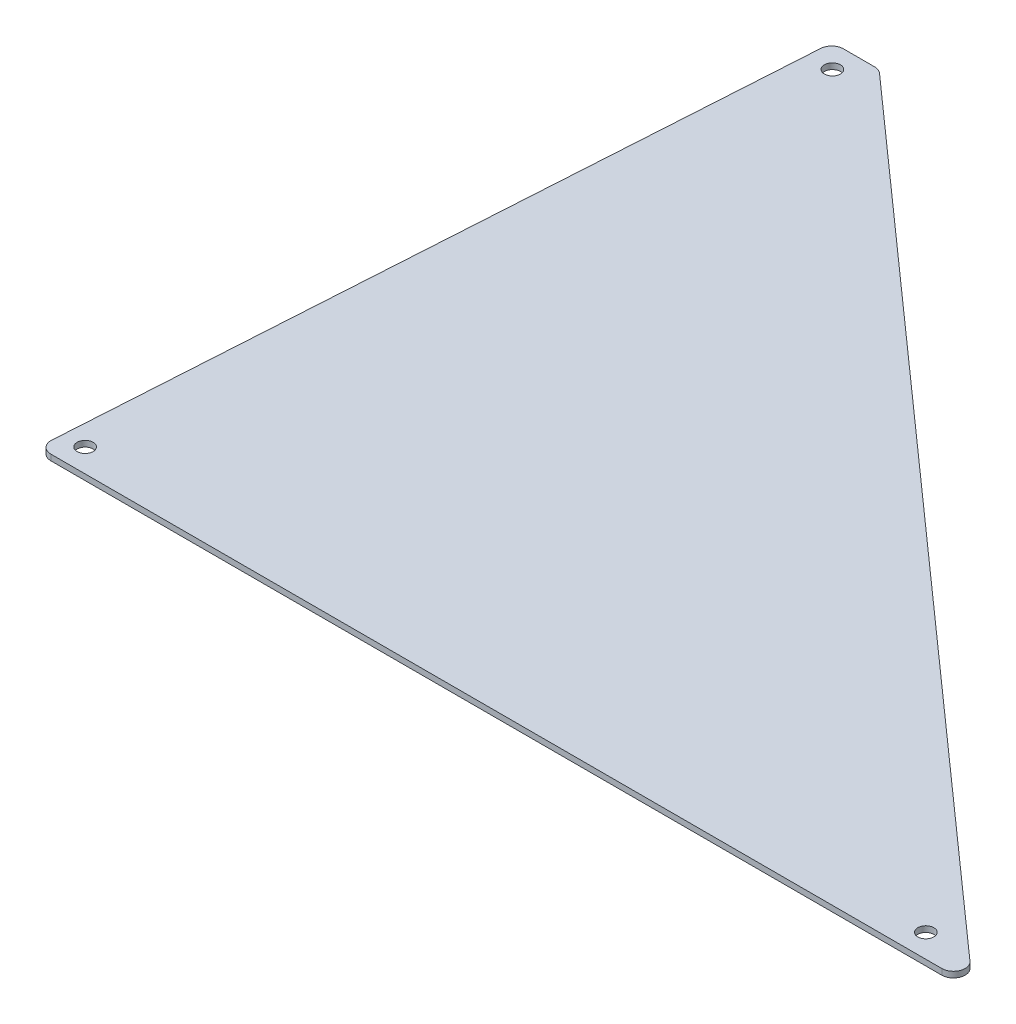
ISO-10303-21;
HEADER;
FILE_DESCRIPTION(('STEP AP214'),'2;1');
FILE_NAME('part.step','',(''),(''),'','','');
FILE_SCHEMA(('AUTOMOTIVE_DESIGN { 1 0 10303 214 1 1 1 1 }'));
ENDSEC;
DATA;
#1=APPLICATION_CONTEXT('core data for automotive mechanical design processes');
#2=APPLICATION_PROTOCOL_DEFINITION('international standard','automotive_design',2000,#1);
#3=PRODUCT_CONTEXT('',#1,'mechanical');
#4=PRODUCT('Part','Part','',(#3));
#5=PRODUCT_RELATED_PRODUCT_CATEGORY('part','',(#4));
#6=PRODUCT_DEFINITION_FORMATION('','',#4);
#7=PRODUCT_DEFINITION_CONTEXT('part definition',#1,'design');
#8=PRODUCT_DEFINITION('design','',#6,#7);
#9=PRODUCT_DEFINITION_SHAPE('','',#8);
#10=(LENGTH_UNIT() NAMED_UNIT(*) SI_UNIT(.MILLI.,.METRE.));
#11=(NAMED_UNIT(*) PLANE_ANGLE_UNIT() SI_UNIT($,.RADIAN.));
#12=(NAMED_UNIT(*) SI_UNIT($,.STERADIAN.) SOLID_ANGLE_UNIT());
#13=UNCERTAINTY_MEASURE_WITH_UNIT(LENGTH_MEASURE(1.E-05),#10,'distance_accuracy_value','');
#14=(GEOMETRIC_REPRESENTATION_CONTEXT(3) GLOBAL_UNCERTAINTY_ASSIGNED_CONTEXT((#13)) GLOBAL_UNIT_ASSIGNED_CONTEXT((#10,
#11,#12)) REPRESENTATION_CONTEXT('',''));
#15=CARTESIAN_POINT('',(0.,0.,0.));
#16=DIRECTION('',(0.,0.,1.));
#17=DIRECTION('',(1.,0.,0.));
#18=AXIS2_PLACEMENT_3D('',#15,#16,#17);
#19=CARTESIAN_POINT('',(3.37963262784209,1.5875,-3.175));
#20=DIRECTION('',(0.,1.,0.));
#21=DIRECTION('',(0.,0.,1.));
#22=AXIS2_PLACEMENT_3D('',#19,#20,#21);
#23=PLANE('',#22);
#24=CARTESIAN_POINT('',(6.35,1.5875,-6.35));
#25=DIRECTION('',(0.,1.,0.));
#26=DIRECTION('',(0.,0.,1.));
#27=AXIS2_PLACEMENT_3D('',#24,#25,#26);
#28=CIRCLE('',#27,2.1828125);
#29=CARTESIAN_POINT('',(6.35,1.5875,-4.1671875));
#30=VERTEX_POINT('',#29);
#31=EDGE_CURVE('E187',#30,#30,#28,.T.);
#32=ORIENTED_EDGE('',*,*,#31,.F.);
#33=EDGE_LOOP('',(#32));
#34=FACE_BOUND('',#33,.T.);
#35=CARTESIAN_POINT('',(3.37963262784209,1.5875,-3.175));
#36=DIRECTION('',(0.,1.,0.));
#37=DIRECTION('',(0.,0.,1.));
#38=AXIS2_PLACEMENT_3D('',#35,#36,#37);
#39=CIRCLE('',#38,3.175);
#40=CARTESIAN_POINT('',(0.21081569115892,1.5875,-3.37305105854272));
#41=VERTEX_POINT('',#40);
#42=CARTESIAN_POINT('',(3.37963262784211,1.5875,0.));
#43=VERTEX_POINT('',#42);
#44=EDGE_CURVE('E150',#41,#43,#39,.T.);
#45=ORIENTED_EDGE('',*,*,#44,.T.);
#46=DIRECTION('',(1.,0.,0.));
#47=VECTOR('',#46,1.);
#48=CARTESIAN_POINT('',(3.37963262784211,1.5875,0.));
#49=LINE('',#48,#47);
#50=CARTESIAN_POINT('',(245.649117151542,1.5875,0.));
#51=VERTEX_POINT('',#50);
#52=EDGE_CURVE('E98',#43,#51,#49,.T.);
#53=ORIENTED_EDGE('',*,*,#52,.T.);
#54=CARTESIAN_POINT('',(245.649117151542,1.5875,-3.175));
#55=DIRECTION('',(0.,1.,0.));
#56=DIRECTION('',(0.,0.,1.));
#57=AXIS2_PLACEMENT_3D('',#54,#55,#56);
#58=CIRCLE('',#57,3.175);
#59=CARTESIAN_POINT('',(247.758472339827,1.5875,-5.54802458682068));
#60=VERTEX_POINT('',#59);
#61=EDGE_CURVE('E165',#51,#60,#58,.T.);
#62=ORIENTED_EDGE('',*,*,#61,.T.);
#63=DIRECTION('',(-0.74740931868366,0.,-0.66436383882992));
#64=VECTOR('',#63,1.);
#65=CARTESIAN_POINT('',(247.758472339827,1.5875,-5.54802458682068));
#66=LINE('',#65,#64);
#67=CARTESIAN_POINT('',(26.3022223398268,1.5875,-202.398024586821));
#68=VERTEX_POINT('',#67);
#69=EDGE_CURVE('E178',#60,#68,#66,.T.);
#70=ORIENTED_EDGE('',*,*,#69,.T.);
#71=CARTESIAN_POINT('',(24.1928671515418,1.5875,-200.025));
#72=DIRECTION('',(0.,1.,0.));
#73=DIRECTION('',(0.,0.,1.));
#74=AXIS2_PLACEMENT_3D('',#71,#72,#73);
#75=CIRCLE('',#74,3.17500000000001);
#76=CARTESIAN_POINT('',(24.1928671515418,1.5875,-203.2));
#77=VERTEX_POINT('',#76);
#78=EDGE_CURVE('E117',#68,#77,#75,.T.);
#79=ORIENTED_EDGE('',*,*,#78,.T.);
#80=DIRECTION('',(-1.,0.,0.));
#81=VECTOR('',#80,1.);
#82=CARTESIAN_POINT('',(24.1928671515418,1.5875,-203.2));
#83=LINE('',#82,#81);
#84=CARTESIAN_POINT('',(15.6827576278421,1.5875,-203.2));
#85=VERTEX_POINT('',#84);
#86=EDGE_CURVE('E111',#77,#85,#83,.T.);
#87=ORIENTED_EDGE('',*,*,#86,.T.);
#88=CARTESIAN_POINT('',(15.6827576278421,1.5875,-200.025));
#89=DIRECTION('',(0.,1.,0.));
#90=DIRECTION('',(0.,0.,1.));
#91=AXIS2_PLACEMENT_3D('',#88,#89,#90);
#92=CIRCLE('',#91,3.17500000000001);
#93=CARTESIAN_POINT('',(12.5139406911589,1.5875,-200.223051058543));
#94=VERTEX_POINT('',#93);
#95=EDGE_CURVE('E115',#85,#94,#92,.T.);
#96=ORIENTED_EDGE('',*,*,#95,.T.);
#97=DIRECTION('',(-0.0623782861551804,0.,0.998052578482889));
#98=VECTOR('',#97,1.);
#99=CARTESIAN_POINT('',(12.5139406911589,1.5875,-200.223051058543));
#100=LINE('',#99,#98);
#101=EDGE_CURVE('E55',#94,#41,#100,.T.);
#102=ORIENTED_EDGE('',*,*,#101,.T.);
#103=EDGE_LOOP('',(#45,#53,#62,#70,#79,#87,#96,#102));
#104=FACE_BOUND('',#103,.T.);
#105=CARTESIAN_POINT('',(234.95,1.5875,-6.35));
#106=DIRECTION('',(0.,1.,0.));
#107=DIRECTION('',(0.,0.,1.));
#108=AXIS2_PLACEMENT_3D('',#105,#106,#107);
#109=CIRCLE('',#108,2.1828125);
#110=CARTESIAN_POINT('',(234.95,1.5875,-4.1671875));
#111=VERTEX_POINT('',#110);
#112=EDGE_CURVE('E139',#111,#111,#109,.T.);
#113=ORIENTED_EDGE('',*,*,#112,.F.);
#114=EDGE_LOOP('',(#113));
#115=FACE_BOUND('',#114,.T.);
#116=CARTESIAN_POINT('',(19.05,1.5875,-196.85));
#117=DIRECTION('',(0.,1.,0.));
#118=DIRECTION('',(0.,0.,1.));
#119=AXIS2_PLACEMENT_3D('',#116,#117,#118);
#120=CIRCLE('',#119,2.1828125);
#121=CARTESIAN_POINT('',(19.05,1.5875,-194.6671875));
#122=VERTEX_POINT('',#121);
#123=EDGE_CURVE('E193',#122,#122,#120,.T.);
#124=ORIENTED_EDGE('',*,*,#123,.F.);
#125=EDGE_LOOP('',(#124));
#126=FACE_BOUND('',#125,.T.);
#127=ADVANCED_FACE('F38',(#34,#104,#115,#126),#23,.T.);
#128=CARTESIAN_POINT('',(3.37963262784209,0.,-3.175));
#129=DIRECTION('',(0.,1.,0.));
#130=DIRECTION('',(0.,0.,1.));
#131=AXIS2_PLACEMENT_3D('',#128,#129,#130);
#132=PLANE('',#131);
#133=CARTESIAN_POINT('',(3.37963262784209,0.,-3.175));
#134=DIRECTION('',(0.,1.,0.));
#135=DIRECTION('',(0.,0.,1.));
#136=AXIS2_PLACEMENT_3D('',#133,#134,#135);
#137=CIRCLE('',#136,3.175);
#138=CARTESIAN_POINT('',(0.21081569115892,0.,-3.37305105854272));
#139=VERTEX_POINT('',#138);
#140=CARTESIAN_POINT('',(3.37963262784211,0.,0.));
#141=VERTEX_POINT('',#140);
#142=EDGE_CURVE('E135',#139,#141,#137,.T.);
#143=ORIENTED_EDGE('',*,*,#142,.F.);
#144=DIRECTION('',(-0.0623782861551804,0.,0.998052578482889));
#145=VECTOR('',#144,1.);
#146=CARTESIAN_POINT('',(12.5139406911589,0.,-200.223051058543));
#147=LINE('',#146,#145);
#148=CARTESIAN_POINT('',(12.5139406911589,0.,-200.223051058543));
#149=VERTEX_POINT('',#148);
#150=EDGE_CURVE('E90',#149,#139,#147,.T.);
#151=ORIENTED_EDGE('',*,*,#150,.F.);
#152=CARTESIAN_POINT('',(15.6827576278421,0.,-200.025));
#153=DIRECTION('',(0.,1.,0.));
#154=DIRECTION('',(0.,0.,1.));
#155=AXIS2_PLACEMENT_3D('',#152,#153,#154);
#156=CIRCLE('',#155,3.17500000000001);
#157=CARTESIAN_POINT('',(15.6827576278421,0.,-203.2));
#158=VERTEX_POINT('',#157);
#159=EDGE_CURVE('E84',#158,#149,#156,.T.);
#160=ORIENTED_EDGE('',*,*,#159,.F.);
#161=DIRECTION('',(-1.,0.,0.));
#162=VECTOR('',#161,1.);
#163=CARTESIAN_POINT('',(24.1928671515418,0.,-203.2));
#164=LINE('',#163,#162);
#165=CARTESIAN_POINT('',(24.1928671515418,0.,-203.2));
#166=VERTEX_POINT('',#165);
#167=EDGE_CURVE('E125',#166,#158,#164,.T.);
#168=ORIENTED_EDGE('',*,*,#167,.F.);
#169=CARTESIAN_POINT('',(24.1928671515418,0.,-200.025));
#170=DIRECTION('',(0.,1.,0.));
#171=DIRECTION('',(0.,0.,1.));
#172=AXIS2_PLACEMENT_3D('',#169,#170,#171);
#173=CIRCLE('',#172,3.17500000000001);
#174=CARTESIAN_POINT('',(26.3022223398268,0.,-202.398024586821));
#175=VERTEX_POINT('',#174);
#176=EDGE_CURVE('E145',#175,#166,#173,.T.);
#177=ORIENTED_EDGE('',*,*,#176,.F.);
#178=DIRECTION('',(-0.74740931868366,0.,-0.66436383882992));
#179=VECTOR('',#178,1.);
#180=CARTESIAN_POINT('',(247.758472339827,0.,-5.54802458682068));
#181=LINE('',#180,#179);
#182=CARTESIAN_POINT('',(247.758472339827,0.,-5.54802458682068));
#183=VERTEX_POINT('',#182);
#184=EDGE_CURVE('E143',#183,#175,#181,.T.);
#185=ORIENTED_EDGE('',*,*,#184,.F.);
#186=CARTESIAN_POINT('',(245.649117151542,0.,-3.175));
#187=DIRECTION('',(0.,1.,0.));
#188=DIRECTION('',(0.,0.,1.));
#189=AXIS2_PLACEMENT_3D('',#186,#187,#188);
#190=CIRCLE('',#189,3.175);
#191=CARTESIAN_POINT('',(245.649117151542,0.,0.));
#192=VERTEX_POINT('',#191);
#193=EDGE_CURVE('E141',#192,#183,#190,.T.);
#194=ORIENTED_EDGE('',*,*,#193,.F.);
#195=DIRECTION('',(1.,0.,0.));
#196=VECTOR('',#195,1.);
#197=CARTESIAN_POINT('',(3.37963262784211,0.,0.));
#198=LINE('',#197,#196);
#199=EDGE_CURVE('E138',#141,#192,#198,.T.);
#200=ORIENTED_EDGE('',*,*,#199,.F.);
#201=EDGE_LOOP('',(#143,#151,#160,#168,#177,#185,#194,#200));
#202=FACE_BOUND('',#201,.T.);
#203=CARTESIAN_POINT('',(234.95,0.,-6.35));
#204=DIRECTION('',(0.,1.,0.));
#205=DIRECTION('',(0.,0.,1.));
#206=AXIS2_PLACEMENT_3D('',#203,#204,#205);
#207=CIRCLE('',#206,2.1828125);
#208=CARTESIAN_POINT('',(234.95,0.,-4.1671875));
#209=VERTEX_POINT('',#208);
#210=EDGE_CURVE('E184',#209,#209,#207,.T.);
#211=ORIENTED_EDGE('',*,*,#210,.T.);
#212=EDGE_LOOP('',(#211));
#213=FACE_BOUND('',#212,.T.);
#214=CARTESIAN_POINT('',(6.35,0.,-6.35));
#215=DIRECTION('',(0.,1.,0.));
#216=DIRECTION('',(0.,0.,1.));
#217=AXIS2_PLACEMENT_3D('',#214,#215,#216);
#218=CIRCLE('',#217,2.1828125);
#219=CARTESIAN_POINT('',(6.35,0.,-4.1671875));
#220=VERTEX_POINT('',#219);
#221=EDGE_CURVE('E190',#220,#220,#218,.T.);
#222=ORIENTED_EDGE('',*,*,#221,.T.);
#223=EDGE_LOOP('',(#222));
#224=FACE_BOUND('',#223,.T.);
#225=CARTESIAN_POINT('',(19.05,0.,-196.85));
#226=DIRECTION('',(0.,1.,0.));
#227=DIRECTION('',(0.,0.,1.));
#228=AXIS2_PLACEMENT_3D('',#225,#226,#227);
#229=CIRCLE('',#228,2.1828125);
#230=CARTESIAN_POINT('',(19.05,0.,-194.6671875));
#231=VERTEX_POINT('',#230);
#232=EDGE_CURVE('E196',#231,#231,#229,.T.);
#233=ORIENTED_EDGE('',*,*,#232,.T.);
#234=EDGE_LOOP('',(#233));
#235=FACE_BOUND('',#234,.T.);
#236=ADVANCED_FACE('F169',(#202,#213,#224,#235),#132,.F.);
#237=CARTESIAN_POINT('',(3.37963262784209,1.5875,-3.175));
#238=DIRECTION('',(0.,-1.,0.));
#239=DIRECTION('',(0.,0.,-1.));
#240=AXIS2_PLACEMENT_3D('',#237,#238,#239);
#241=CYLINDRICAL_SURFACE('',#240,3.175);
#242=ORIENTED_EDGE('',*,*,#142,.T.);
#243=DIRECTION('',(0.,-1.,0.));
#244=VECTOR('',#243,1.);
#245=CARTESIAN_POINT('',(3.37963262784211,1.5875,0.));
#246=LINE('',#245,#244);
#247=EDGE_CURVE('E11',#43,#141,#246,.T.);
#248=ORIENTED_EDGE('',*,*,#247,.F.);
#249=ORIENTED_EDGE('',*,*,#44,.F.);
#250=DIRECTION('',(0.,-1.,0.));
#251=VECTOR('',#250,1.);
#252=CARTESIAN_POINT('',(0.21081569115892,1.5875,-3.37305105854272));
#253=LINE('',#252,#251);
#254=EDGE_CURVE('E131',#41,#139,#253,.T.);
#255=ORIENTED_EDGE('',*,*,#254,.T.);
#256=EDGE_LOOP('',(#242,#248,#249,#255));
#257=FACE_BOUND('',#256,.T.);
#258=ADVANCED_FACE('F40',(#257),#241,.T.);
#259=CARTESIAN_POINT('',(3.37963262784211,1.5875,0.));
#260=DIRECTION('',(0.,0.,-1.));
#261=DIRECTION('',(-1.,0.,0.));
#262=AXIS2_PLACEMENT_3D('',#259,#260,#261);
#263=PLANE('',#262);
#264=ORIENTED_EDGE('',*,*,#199,.T.);
#265=DIRECTION('',(0.,-1.,0.));
#266=VECTOR('',#265,1.);
#267=CARTESIAN_POINT('',(245.649117151542,1.5875,0.));
#268=LINE('',#267,#266);
#269=EDGE_CURVE('E47',#51,#192,#268,.T.);
#270=ORIENTED_EDGE('',*,*,#269,.F.);
#271=ORIENTED_EDGE('',*,*,#52,.F.);
#272=ORIENTED_EDGE('',*,*,#247,.T.);
#273=EDGE_LOOP('',(#264,#270,#271,#272));
#274=FACE_BOUND('',#273,.T.);
#275=ADVANCED_FACE('F229',(#274),#263,.F.);
#276=CARTESIAN_POINT('',(245.649117151542,1.5875,-3.175));
#277=DIRECTION('',(0.,-1.,0.));
#278=DIRECTION('',(0.,0.,-1.));
#279=AXIS2_PLACEMENT_3D('',#276,#277,#278);
#280=CYLINDRICAL_SURFACE('',#279,3.175);
#281=ORIENTED_EDGE('',*,*,#193,.T.);
#282=DIRECTION('',(0.,-1.,0.));
#283=VECTOR('',#282,1.);
#284=CARTESIAN_POINT('',(247.758472339827,1.5875,-5.54802458682068));
#285=LINE('',#284,#283);
#286=EDGE_CURVE('E157',#60,#183,#285,.T.);
#287=ORIENTED_EDGE('',*,*,#286,.F.);
#288=ORIENTED_EDGE('',*,*,#61,.F.);
#289=ORIENTED_EDGE('',*,*,#269,.T.);
#290=EDGE_LOOP('',(#281,#287,#288,#289));
#291=FACE_BOUND('',#290,.T.);
#292=ADVANCED_FACE('F163',(#291),#280,.T.);
#293=CARTESIAN_POINT('',(247.758472339827,1.5875,-5.54802458682068));
#294=DIRECTION('',(-0.66436383882992,0.,0.74740931868366));
#295=DIRECTION('',(0.74740931868366,0.,0.66436383882992));
#296=AXIS2_PLACEMENT_3D('',#293,#294,#295);
#297=PLANE('',#296);
#298=ORIENTED_EDGE('',*,*,#184,.T.);
#299=DIRECTION('',(0.,-1.,0.));
#300=VECTOR('',#299,1.);
#301=CARTESIAN_POINT('',(26.3022223398268,1.5875,-202.398024586821));
#302=LINE('',#301,#300);
#303=EDGE_CURVE('E154',#68,#175,#302,.T.);
#304=ORIENTED_EDGE('',*,*,#303,.F.);
#305=ORIENTED_EDGE('',*,*,#69,.F.);
#306=ORIENTED_EDGE('',*,*,#286,.T.);
#307=EDGE_LOOP('',(#298,#304,#305,#306));
#308=FACE_BOUND('',#307,.T.);
#309=ADVANCED_FACE('F174',(#308),#297,.F.);
#310=CARTESIAN_POINT('',(24.1928671515418,1.5875,-200.025));
#311=DIRECTION('',(0.,-1.,0.));
#312=DIRECTION('',(0.,0.,-1.));
#313=AXIS2_PLACEMENT_3D('',#310,#311,#312);
#314=CYLINDRICAL_SURFACE('',#313,3.17500000000001);
#315=ORIENTED_EDGE('',*,*,#176,.T.);
#316=DIRECTION('',(0.,-1.,0.));
#317=VECTOR('',#316,1.);
#318=CARTESIAN_POINT('',(24.1928671515418,1.5875,-203.2));
#319=LINE('',#318,#317);
#320=EDGE_CURVE('E126',#77,#166,#319,.T.);
#321=ORIENTED_EDGE('',*,*,#320,.F.);
#322=ORIENTED_EDGE('',*,*,#78,.F.);
#323=ORIENTED_EDGE('',*,*,#303,.T.);
#324=EDGE_LOOP('',(#315,#321,#322,#323));
#325=FACE_BOUND('',#324,.T.);
#326=ADVANCED_FACE('F177',(#325),#314,.T.);
#327=CARTESIAN_POINT('',(24.1928671515418,1.5875,-203.2));
#328=DIRECTION('',(0.,0.,1.));
#329=DIRECTION('',(1.,0.,0.));
#330=AXIS2_PLACEMENT_3D('',#327,#328,#329);
#331=PLANE('',#330);
#332=ORIENTED_EDGE('',*,*,#167,.T.);
#333=DIRECTION('',(0.,-1.,0.));
#334=VECTOR('',#333,1.);
#335=CARTESIAN_POINT('',(15.6827576278421,1.5875,-203.2));
#336=LINE('',#335,#334);
#337=EDGE_CURVE('E122',#85,#158,#336,.T.);
#338=ORIENTED_EDGE('',*,*,#337,.F.);
#339=ORIENTED_EDGE('',*,*,#86,.F.);
#340=ORIENTED_EDGE('',*,*,#320,.T.);
#341=EDGE_LOOP('',(#332,#338,#339,#340));
#342=FACE_BOUND('',#341,.T.);
#343=ADVANCED_FACE('F123',(#342),#331,.F.);
#344=CARTESIAN_POINT('',(15.6827576278421,1.5875,-200.025));
#345=DIRECTION('',(0.,-1.,0.));
#346=DIRECTION('',(0.,0.,-1.));
#347=AXIS2_PLACEMENT_3D('',#344,#345,#346);
#348=CYLINDRICAL_SURFACE('',#347,3.17500000000001);
#349=ORIENTED_EDGE('',*,*,#159,.T.);
#350=DIRECTION('',(0.,-1.,0.));
#351=VECTOR('',#350,1.);
#352=CARTESIAN_POINT('',(12.5139406911589,1.5875,-200.223051058543));
#353=LINE('',#352,#351);
#354=EDGE_CURVE('E127',#94,#149,#353,.T.);
#355=ORIENTED_EDGE('',*,*,#354,.F.);
#356=ORIENTED_EDGE('',*,*,#95,.F.);
#357=ORIENTED_EDGE('',*,*,#337,.T.);
#358=EDGE_LOOP('',(#349,#355,#356,#357));
#359=FACE_BOUND('',#358,.T.);
#360=ADVANCED_FACE('F129',(#359),#348,.T.);
#361=CARTESIAN_POINT('',(12.5139406911589,1.5875,-200.223051058543));
#362=DIRECTION('',(0.998052578482889,0.,0.0623782861551804));
#363=DIRECTION('',(0.0623782861551804,0.,-0.998052578482889));
#364=AXIS2_PLACEMENT_3D('',#361,#362,#363);
#365=PLANE('',#364);
#366=ORIENTED_EDGE('',*,*,#150,.T.);
#367=ORIENTED_EDGE('',*,*,#254,.F.);
#368=ORIENTED_EDGE('',*,*,#101,.F.);
#369=ORIENTED_EDGE('',*,*,#354,.T.);
#370=EDGE_LOOP('',(#366,#367,#368,#369));
#371=FACE_BOUND('',#370,.T.);
#372=ADVANCED_FACE('F217',(#371),#365,.F.);
#373=CARTESIAN_POINT('',(234.95,1.5875,-6.35));
#374=DIRECTION('',(0.,-1.,0.));
#375=DIRECTION('',(0.,0.,-1.));
#376=AXIS2_PLACEMENT_3D('',#373,#374,#375);
#377=CYLINDRICAL_SURFACE('',#376,2.1828125);
#378=ORIENTED_EDGE('',*,*,#112,.T.);
#379=EDGE_LOOP('',(#378));
#380=FACE_BOUND('',#379,.T.);
#381=ORIENTED_EDGE('',*,*,#210,.F.);
#382=EDGE_LOOP('',(#381));
#383=FACE_BOUND('',#382,.T.);
#384=ADVANCED_FACE('F214',(#380,#383),#377,.F.);
#385=CARTESIAN_POINT('',(6.35,1.5875,-6.35));
#386=DIRECTION('',(0.,-1.,0.));
#387=DIRECTION('',(0.,0.,-1.));
#388=AXIS2_PLACEMENT_3D('',#385,#386,#387);
#389=CYLINDRICAL_SURFACE('',#388,2.1828125);
#390=ORIENTED_EDGE('',*,*,#31,.T.);
#391=EDGE_LOOP('',(#390));
#392=FACE_BOUND('',#391,.T.);
#393=ORIENTED_EDGE('',*,*,#221,.F.);
#394=EDGE_LOOP('',(#393));
#395=FACE_BOUND('',#394,.T.);
#396=ADVANCED_FACE('F293',(#392,#395),#389,.F.);
#397=CARTESIAN_POINT('',(19.05,1.5875,-196.85));
#398=DIRECTION('',(0.,-1.,0.));
#399=DIRECTION('',(0.,0.,-1.));
#400=AXIS2_PLACEMENT_3D('',#397,#398,#399);
#401=CYLINDRICAL_SURFACE('',#400,2.1828125);
#402=ORIENTED_EDGE('',*,*,#123,.T.);
#403=EDGE_LOOP('',(#402));
#404=FACE_BOUND('',#403,.T.);
#405=ORIENTED_EDGE('',*,*,#232,.F.);
#406=EDGE_LOOP('',(#405));
#407=FACE_BOUND('',#406,.T.);
#408=ADVANCED_FACE('F202',(#404,#407),#401,.F.);
#409=CLOSED_SHELL('',(#127,#236,#258,#275,#292,#309,#326,#343,#360,#372,#384,#396,#408));
#410=MANIFOLD_SOLID_BREP('B2',#409);
#411=ADVANCED_BREP_SHAPE_REPRESENTATION('',(#18,#410),#14);
#412=SHAPE_DEFINITION_REPRESENTATION(#9,#411);
ENDSEC;
END-ISO-10303-21;
